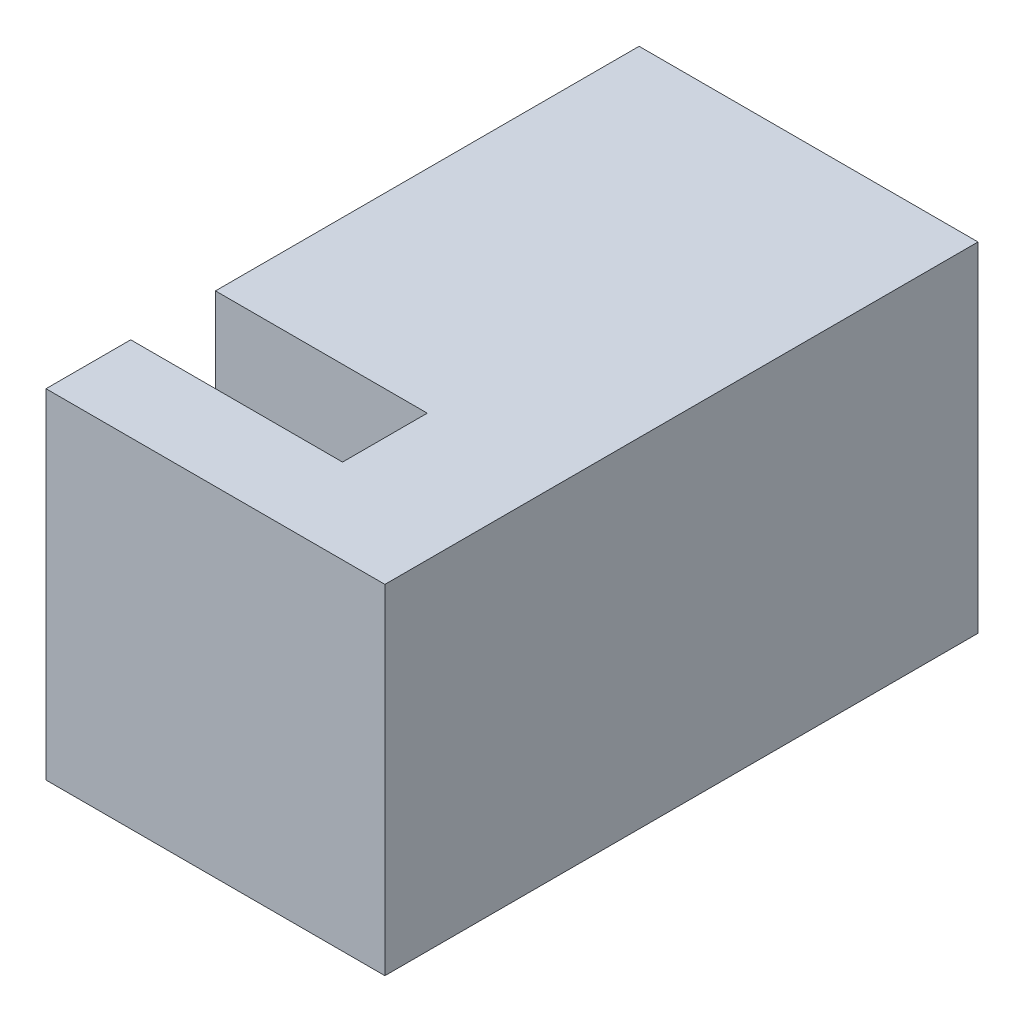
ISO-10303-21;
HEADER;
FILE_DESCRIPTION(('STEP AP214'),'2;1');
FILE_NAME('part.step','',(''),(''),'','','');
FILE_SCHEMA(('AUTOMOTIVE_DESIGN { 1 0 10303 214 1 1 1 1 }'));
ENDSEC;
DATA;
#1=APPLICATION_CONTEXT('core data for automotive mechanical design processes');
#2=APPLICATION_PROTOCOL_DEFINITION('international standard','automotive_design',2000,#1);
#3=PRODUCT_CONTEXT('',#1,'mechanical');
#4=PRODUCT('Part','Part','',(#3));
#5=PRODUCT_RELATED_PRODUCT_CATEGORY('part','',(#4));
#6=PRODUCT_DEFINITION_FORMATION('','',#4);
#7=PRODUCT_DEFINITION_CONTEXT('part definition',#1,'design');
#8=PRODUCT_DEFINITION('design','',#6,#7);
#9=PRODUCT_DEFINITION_SHAPE('','',#8);
#10=(LENGTH_UNIT() NAMED_UNIT(*) SI_UNIT(.MILLI.,.METRE.));
#11=(NAMED_UNIT(*) PLANE_ANGLE_UNIT() SI_UNIT($,.RADIAN.));
#12=(NAMED_UNIT(*) SI_UNIT($,.STERADIAN.) SOLID_ANGLE_UNIT());
#13=UNCERTAINTY_MEASURE_WITH_UNIT(LENGTH_MEASURE(1.E-05),#10,'distance_accuracy_value','');
#14=(GEOMETRIC_REPRESENTATION_CONTEXT(3) GLOBAL_UNCERTAINTY_ASSIGNED_CONTEXT((#13)) GLOBAL_UNIT_ASSIGNED_CONTEXT((#10,
#11,#12)) REPRESENTATION_CONTEXT('',''));
#15=CARTESIAN_POINT('',(0.,0.,0.));
#16=DIRECTION('',(0.,0.,1.));
#17=DIRECTION('',(1.,0.,0.));
#18=AXIS2_PLACEMENT_3D('',#15,#16,#17);
#19=CARTESIAN_POINT('',(0.,0.,14.));
#20=DIRECTION('',(1.,0.,0.));
#21=DIRECTION('',(0.,0.,-1.));
#22=AXIS2_PLACEMENT_3D('',#19,#20,#21);
#23=PLANE('',#22);
#24=DIRECTION('',(0.,0.,1.));
#25=VECTOR('',#24,1.);
#26=CARTESIAN_POINT('',(0.,3.,10.));
#27=LINE('',#26,#25);
#28=CARTESIAN_POINT('',(0.,3.,10.));
#29=VERTEX_POINT('',#28);
#30=CARTESIAN_POINT('',(0.,3.,12.));
#31=VERTEX_POINT('',#30);
#32=EDGE_CURVE('E118',#29,#31,#27,.T.);
#33=ORIENTED_EDGE('',*,*,#32,.F.);
#34=DIRECTION('',(0.,1.,0.));
#35=VECTOR('',#34,1.);
#36=CARTESIAN_POINT('',(0.,3.,10.));
#37=LINE('',#36,#35);
#38=CARTESIAN_POINT('',(0.,8.,10.));
#39=VERTEX_POINT('',#38);
#40=EDGE_CURVE('E146',#29,#39,#37,.T.);
#41=ORIENTED_EDGE('',*,*,#40,.T.);
#42=DIRECTION('',(0.,0.,-1.));
#43=VECTOR('',#42,1.);
#44=CARTESIAN_POINT('',(0.,8.,14.));
#45=LINE('',#44,#43);
#46=CARTESIAN_POINT('',(0.,8.,0.));
#47=VERTEX_POINT('',#46);
#48=EDGE_CURVE('E82',#39,#47,#45,.T.);
#49=ORIENTED_EDGE('',*,*,#48,.T.);
#50=DIRECTION('',(0.,-1.,0.));
#51=VECTOR('',#50,1.);
#52=CARTESIAN_POINT('',(0.,0.,0.));
#53=LINE('',#52,#51);
#54=CARTESIAN_POINT('',(0.,0.,0.));
#55=VERTEX_POINT('',#54);
#56=EDGE_CURVE('E143',#47,#55,#53,.T.);
#57=ORIENTED_EDGE('',*,*,#56,.T.);
#58=DIRECTION('',(0.,0.,-1.));
#59=VECTOR('',#58,1.);
#60=CARTESIAN_POINT('',(0.,0.,14.));
#61=LINE('',#60,#59);
#62=CARTESIAN_POINT('',(0.,0.,14.));
#63=VERTEX_POINT('',#62);
#64=EDGE_CURVE('E11',#63,#55,#61,.T.);
#65=ORIENTED_EDGE('',*,*,#64,.F.);
#66=DIRECTION('',(0.,-1.,0.));
#67=VECTOR('',#66,1.);
#68=CARTESIAN_POINT('',(0.,0.,14.));
#69=LINE('',#68,#67);
#70=CARTESIAN_POINT('',(0.,8.,14.));
#71=VERTEX_POINT('',#70);
#72=EDGE_CURVE('E136',#71,#63,#69,.T.);
#73=ORIENTED_EDGE('',*,*,#72,.F.);
#74=CARTESIAN_POINT('',(0.,8.,12.));
#75=VERTEX_POINT('',#74);
#76=EDGE_CURVE('E129',#71,#75,#45,.T.);
#77=ORIENTED_EDGE('',*,*,#76,.T.);
#78=DIRECTION('',(0.,1.,0.));
#79=VECTOR('',#78,1.);
#80=CARTESIAN_POINT('',(0.,3.,12.));
#81=LINE('',#80,#79);
#82=EDGE_CURVE('E51',#31,#75,#81,.T.);
#83=ORIENTED_EDGE('',*,*,#82,.F.);
#84=EDGE_LOOP('',(#33,#41,#49,#57,#65,#73,#77,#83));
#85=FACE_BOUND('',#84,.T.);
#86=ADVANCED_FACE('F37',(#85),#23,.F.);
#87=CARTESIAN_POINT('',(0.,0.,14.));
#88=DIRECTION('',(0.,1.,0.));
#89=DIRECTION('',(0.,0.,1.));
#90=AXIS2_PLACEMENT_3D('',#87,#88,#89);
#91=PLANE('',#90);
#92=DIRECTION('',(1.,0.,0.));
#93=VECTOR('',#92,1.);
#94=CARTESIAN_POINT('',(0.,0.,0.));
#95=LINE('',#94,#93);
#96=CARTESIAN_POINT('',(8.,0.,0.));
#97=VERTEX_POINT('',#96);
#98=EDGE_CURVE('E145',#55,#97,#95,.T.);
#99=ORIENTED_EDGE('',*,*,#98,.T.);
#100=DIRECTION('',(0.,0.,-1.));
#101=VECTOR('',#100,1.);
#102=CARTESIAN_POINT('',(8.,0.,14.));
#103=LINE('',#102,#101);
#104=CARTESIAN_POINT('',(8.,0.,14.));
#105=VERTEX_POINT('',#104);
#106=EDGE_CURVE('E44',#105,#97,#103,.T.);
#107=ORIENTED_EDGE('',*,*,#106,.F.);
#108=DIRECTION('',(1.,0.,0.));
#109=VECTOR('',#108,1.);
#110=CARTESIAN_POINT('',(0.,0.,14.));
#111=LINE('',#110,#109);
#112=EDGE_CURVE('E89',#63,#105,#111,.T.);
#113=ORIENTED_EDGE('',*,*,#112,.F.);
#114=ORIENTED_EDGE('',*,*,#64,.T.);
#115=EDGE_LOOP('',(#99,#107,#113,#114));
#116=FACE_BOUND('',#115,.T.);
#117=ADVANCED_FACE('F183',(#116),#91,.F.);
#118=CARTESIAN_POINT('',(8.,0.,14.));
#119=DIRECTION('',(-1.,0.,0.));
#120=DIRECTION('',(0.,0.,1.));
#121=AXIS2_PLACEMENT_3D('',#118,#119,#120);
#122=PLANE('',#121);
#123=DIRECTION('',(0.,1.,0.));
#124=VECTOR('',#123,1.);
#125=CARTESIAN_POINT('',(8.,0.,0.));
#126=LINE('',#125,#124);
#127=CARTESIAN_POINT('',(8.,8.,0.));
#128=VERTEX_POINT('',#127);
#129=EDGE_CURVE('E148',#97,#128,#126,.T.);
#130=ORIENTED_EDGE('',*,*,#129,.T.);
#131=DIRECTION('',(0.,0.,-1.));
#132=VECTOR('',#131,1.);
#133=CARTESIAN_POINT('',(8.,8.,14.));
#134=LINE('',#133,#132);
#135=CARTESIAN_POINT('',(8.,8.,14.));
#136=VERTEX_POINT('',#135);
#137=EDGE_CURVE('E152',#136,#128,#134,.T.);
#138=ORIENTED_EDGE('',*,*,#137,.F.);
#139=DIRECTION('',(0.,1.,0.));
#140=VECTOR('',#139,1.);
#141=CARTESIAN_POINT('',(8.,0.,14.));
#142=LINE('',#141,#140);
#143=EDGE_CURVE('E140',#105,#136,#142,.T.);
#144=ORIENTED_EDGE('',*,*,#143,.F.);
#145=ORIENTED_EDGE('',*,*,#106,.T.);
#146=EDGE_LOOP('',(#130,#138,#144,#145));
#147=FACE_BOUND('',#146,.T.);
#148=ADVANCED_FACE('F158',(#147),#122,.F.);
#149=CARTESIAN_POINT('',(0.,8.,14.));
#150=DIRECTION('',(0.,-1.,0.));
#151=DIRECTION('',(0.,0.,-1.));
#152=AXIS2_PLACEMENT_3D('',#149,#150,#151);
#153=PLANE('',#152);
#154=ORIENTED_EDGE('',*,*,#48,.F.);
#155=DIRECTION('',(-1.,0.,0.));
#156=VECTOR('',#155,1.);
#157=CARTESIAN_POINT('',(0.,8.,10.));
#158=LINE('',#157,#156);
#159=CARTESIAN_POINT('',(5.,8.,10.));
#160=VERTEX_POINT('',#159);
#161=EDGE_CURVE('E125',#160,#39,#158,.T.);
#162=ORIENTED_EDGE('',*,*,#161,.F.);
#163=DIRECTION('',(0.,0.,-1.));
#164=VECTOR('',#163,1.);
#165=CARTESIAN_POINT('',(5.,8.,10.));
#166=LINE('',#165,#164);
#167=CARTESIAN_POINT('',(5.,8.,12.));
#168=VERTEX_POINT('',#167);
#169=EDGE_CURVE('E304',#168,#160,#166,.T.);
#170=ORIENTED_EDGE('',*,*,#169,.F.);
#171=DIRECTION('',(1.,0.,0.));
#172=VECTOR('',#171,1.);
#173=CARTESIAN_POINT('',(0.,8.,12.));
#174=LINE('',#173,#172);
#175=EDGE_CURVE('E168',#75,#168,#174,.T.);
#176=ORIENTED_EDGE('',*,*,#175,.F.);
#177=ORIENTED_EDGE('',*,*,#76,.F.);
#178=DIRECTION('',(-1.,0.,0.));
#179=VECTOR('',#178,1.);
#180=CARTESIAN_POINT('',(0.,8.,14.));
#181=LINE('',#180,#179);
#182=EDGE_CURVE('E60',#136,#71,#181,.T.);
#183=ORIENTED_EDGE('',*,*,#182,.F.);
#184=ORIENTED_EDGE('',*,*,#137,.T.);
#185=DIRECTION('',(-1.,0.,0.));
#186=VECTOR('',#185,1.);
#187=CARTESIAN_POINT('',(0.,8.,0.));
#188=LINE('',#187,#186);
#189=EDGE_CURVE('E138',#128,#47,#188,.T.);
#190=ORIENTED_EDGE('',*,*,#189,.T.);
#191=EDGE_LOOP('',(#154,#162,#170,#176,#177,#183,#184,#190));
#192=FACE_BOUND('',#191,.T.);
#193=ADVANCED_FACE('F165',(#192),#153,.F.);
#194=CARTESIAN_POINT('',(0.,0.,14.));
#195=DIRECTION('',(0.,0.,-1.));
#196=DIRECTION('',(-1.,0.,0.));
#197=AXIS2_PLACEMENT_3D('',#194,#195,#196);
#198=PLANE('',#197);
#199=ORIENTED_EDGE('',*,*,#72,.T.);
#200=ORIENTED_EDGE('',*,*,#112,.T.);
#201=ORIENTED_EDGE('',*,*,#143,.T.);
#202=ORIENTED_EDGE('',*,*,#182,.T.);
#203=EDGE_LOOP('',(#199,#200,#201,#202));
#204=FACE_BOUND('',#203,.T.);
#205=ADVANCED_FACE('F170',(#204),#198,.F.);
#206=CARTESIAN_POINT('',(0.,0.,0.));
#207=DIRECTION('',(0.,0.,-1.));
#208=DIRECTION('',(-1.,0.,0.));
#209=AXIS2_PLACEMENT_3D('',#206,#207,#208);
#210=PLANE('',#209);
#211=CARTESIAN_POINT('',(4.,4.,0.));
#212=DIRECTION('',(0.,0.,-1.));
#213=DIRECTION('',(-1.,0.,0.));
#214=AXIS2_PLACEMENT_3D('',#211,#212,#213);
#215=CIRCLE('',#214,1.375);
#216=CARTESIAN_POINT('',(2.625,4.,0.));
#217=VERTEX_POINT('',#216);
#218=EDGE_CURVE('E302',#217,#217,#215,.T.);
#219=ORIENTED_EDGE('',*,*,#218,.F.);
#220=EDGE_LOOP('',(#219));
#221=FACE_BOUND('',#220,.T.);
#222=ORIENTED_EDGE('',*,*,#56,.F.);
#223=ORIENTED_EDGE('',*,*,#189,.F.);
#224=ORIENTED_EDGE('',*,*,#129,.F.);
#225=ORIENTED_EDGE('',*,*,#98,.F.);
#226=EDGE_LOOP('',(#222,#223,#224,#225));
#227=FACE_BOUND('',#226,.T.);
#228=ADVANCED_FACE('F163',(#221,#227),#210,.T.);
#229=CARTESIAN_POINT('',(0.,3.,10.));
#230=DIRECTION('',(0.,0.,-1.));
#231=DIRECTION('',(-1.,0.,0.));
#232=AXIS2_PLACEMENT_3D('',#229,#230,#231);
#233=PLANE('',#232);
#234=ORIENTED_EDGE('',*,*,#161,.T.);
#235=ORIENTED_EDGE('',*,*,#40,.F.);
#236=DIRECTION('',(-1.,0.,0.));
#237=VECTOR('',#236,1.);
#238=CARTESIAN_POINT('',(0.,3.,10.));
#239=LINE('',#238,#237);
#240=CARTESIAN_POINT('',(5.,3.,10.));
#241=VERTEX_POINT('',#240);
#242=EDGE_CURVE('E124',#241,#29,#239,.T.);
#243=ORIENTED_EDGE('',*,*,#242,.F.);
#244=DIRECTION('',(0.,1.,0.));
#245=VECTOR('',#244,1.);
#246=CARTESIAN_POINT('',(5.,3.,10.));
#247=LINE('',#246,#245);
#248=EDGE_CURVE('E131',#241,#160,#247,.T.);
#249=ORIENTED_EDGE('',*,*,#248,.T.);
#250=EDGE_LOOP('',(#234,#235,#243,#249));
#251=FACE_BOUND('',#250,.T.);
#252=ADVANCED_FACE('F177',(#251),#233,.F.);
#253=CARTESIAN_POINT('',(5.,3.,10.));
#254=DIRECTION('',(1.,0.,0.));
#255=DIRECTION('',(0.,0.,-1.));
#256=AXIS2_PLACEMENT_3D('',#253,#254,#255);
#257=PLANE('',#256);
#258=ORIENTED_EDGE('',*,*,#169,.T.);
#259=ORIENTED_EDGE('',*,*,#248,.F.);
#260=DIRECTION('',(0.,0.,-1.));
#261=VECTOR('',#260,1.);
#262=CARTESIAN_POINT('',(5.,3.,10.));
#263=LINE('',#262,#261);
#264=CARTESIAN_POINT('',(5.,3.,12.));
#265=VERTEX_POINT('',#264);
#266=EDGE_CURVE('E117',#265,#241,#263,.T.);
#267=ORIENTED_EDGE('',*,*,#266,.F.);
#268=DIRECTION('',(0.,1.,0.));
#269=VECTOR('',#268,1.);
#270=CARTESIAN_POINT('',(5.,3.,12.));
#271=LINE('',#270,#269);
#272=EDGE_CURVE('E113',#265,#168,#271,.T.);
#273=ORIENTED_EDGE('',*,*,#272,.T.);
#274=EDGE_LOOP('',(#258,#259,#267,#273));
#275=FACE_BOUND('',#274,.T.);
#276=ADVANCED_FACE('F210',(#275),#257,.F.);
#277=CARTESIAN_POINT('',(0.,3.,12.));
#278=DIRECTION('',(0.,0.,1.));
#279=DIRECTION('',(1.,0.,0.));
#280=AXIS2_PLACEMENT_3D('',#277,#278,#279);
#281=PLANE('',#280);
#282=ORIENTED_EDGE('',*,*,#175,.T.);
#283=ORIENTED_EDGE('',*,*,#272,.F.);
#284=DIRECTION('',(1.,0.,0.));
#285=VECTOR('',#284,1.);
#286=CARTESIAN_POINT('',(0.,3.,12.));
#287=LINE('',#286,#285);
#288=EDGE_CURVE('E110',#31,#265,#287,.T.);
#289=ORIENTED_EDGE('',*,*,#288,.F.);
#290=ORIENTED_EDGE('',*,*,#82,.T.);
#291=EDGE_LOOP('',(#282,#283,#289,#290));
#292=FACE_BOUND('',#291,.T.);
#293=ADVANCED_FACE('F112',(#292),#281,.F.);
#294=CARTESIAN_POINT('',(0.,3.,0.));
#295=DIRECTION('',(0.,1.,0.));
#296=DIRECTION('',(0.,0.,1.));
#297=AXIS2_PLACEMENT_3D('',#294,#295,#296);
#298=PLANE('',#297);
#299=ORIENTED_EDGE('',*,*,#32,.T.);
#300=ORIENTED_EDGE('',*,*,#288,.T.);
#301=ORIENTED_EDGE('',*,*,#266,.T.);
#302=ORIENTED_EDGE('',*,*,#242,.T.);
#303=EDGE_LOOP('',(#299,#300,#301,#302));
#304=FACE_BOUND('',#303,.T.);
#305=ADVANCED_FACE('F122',(#304),#298,.T.);
#306=CARTESIAN_POINT('',(4.,4.,9.));
#307=DIRECTION('',(0.,0.,-1.));
#308=DIRECTION('',(-1.,0.,0.));
#309=AXIS2_PLACEMENT_3D('',#306,#307,#308);
#310=CYLINDRICAL_SURFACE('',#309,1.375);
#311=CARTESIAN_POINT('',(4.,4.,9.));
#312=DIRECTION('',(0.,0.,-1.));
#313=DIRECTION('',(-1.,0.,0.));
#314=AXIS2_PLACEMENT_3D('',#311,#312,#313);
#315=CIRCLE('',#314,1.375);
#316=CARTESIAN_POINT('',(2.625,4.,9.));
#317=VERTEX_POINT('',#316);
#318=EDGE_CURVE('E301',#317,#317,#315,.T.);
#319=ORIENTED_EDGE('',*,*,#318,.F.);
#320=EDGE_LOOP('',(#319));
#321=FACE_BOUND('',#320,.T.);
#322=ORIENTED_EDGE('',*,*,#218,.T.);
#323=EDGE_LOOP('',(#322));
#324=FACE_BOUND('',#323,.T.);
#325=ADVANCED_FACE('F240',(#321,#324),#310,.F.);
#326=CARTESIAN_POINT('',(4.,4.,9.));
#327=DIRECTION('',(0.,0.,-1.));
#328=DIRECTION('',(-1.,0.,0.));
#329=AXIS2_PLACEMENT_3D('',#326,#327,#328);
#330=PLANE('',#329);
#331=ORIENTED_EDGE('',*,*,#318,.T.);
#332=EDGE_LOOP('',(#331));
#333=FACE_BOUND('',#332,.T.);
#334=ADVANCED_FACE('F256',(#333),#330,.T.);
#335=CLOSED_SHELL('',(#86,#117,#148,#193,#205,#228,#252,#276,#293,#305,#325,#334));
#336=MANIFOLD_SOLID_BREP('B2',#335);
#337=ADVANCED_BREP_SHAPE_REPRESENTATION('',(#18,#336),#14);
#338=SHAPE_DEFINITION_REPRESENTATION(#9,#337);
ENDSEC;
END-ISO-10303-21;
